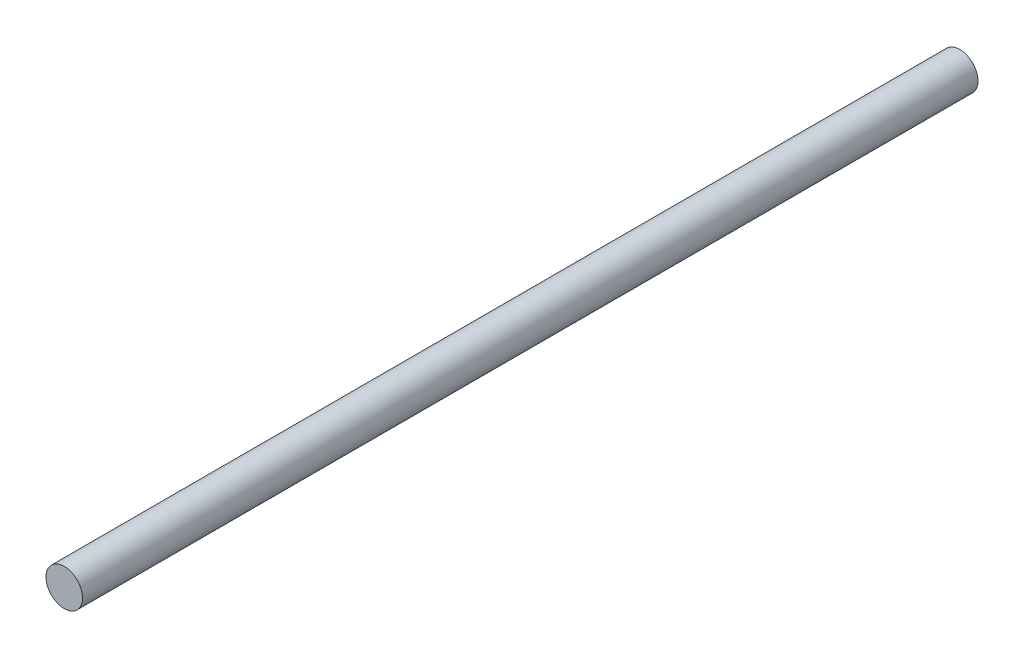
ISO-10303-21;
HEADER;
FILE_DESCRIPTION(('STEP AP214'),'2;1');
FILE_NAME('part.step','',(''),(''),'','','');
FILE_SCHEMA(('AUTOMOTIVE_DESIGN { 1 0 10303 214 1 1 1 1 }'));
ENDSEC;
DATA;
#1=APPLICATION_CONTEXT('core data for automotive mechanical design processes');
#2=APPLICATION_PROTOCOL_DEFINITION('international standard','automotive_design',2000,#1);
#3=PRODUCT_CONTEXT('',#1,'mechanical');
#4=PRODUCT('Part','Part','',(#3));
#5=PRODUCT_RELATED_PRODUCT_CATEGORY('part','',(#4));
#6=PRODUCT_DEFINITION_FORMATION('','',#4);
#7=PRODUCT_DEFINITION_CONTEXT('part definition',#1,'design');
#8=PRODUCT_DEFINITION('design','',#6,#7);
#9=PRODUCT_DEFINITION_SHAPE('','',#8);
#10=(LENGTH_UNIT() NAMED_UNIT(*) SI_UNIT(.MILLI.,.METRE.));
#11=(NAMED_UNIT(*) PLANE_ANGLE_UNIT() SI_UNIT($,.RADIAN.));
#12=(NAMED_UNIT(*) SI_UNIT($,.STERADIAN.) SOLID_ANGLE_UNIT());
#13=UNCERTAINTY_MEASURE_WITH_UNIT(LENGTH_MEASURE(1.E-05),#10,'distance_accuracy_value','');
#14=(GEOMETRIC_REPRESENTATION_CONTEXT(3) GLOBAL_UNCERTAINTY_ASSIGNED_CONTEXT((#13)) GLOBAL_UNIT_ASSIGNED_CONTEXT((#10,
#11,#12)) REPRESENTATION_CONTEXT('',''));
#15=CARTESIAN_POINT('',(0.,0.,0.));
#16=DIRECTION('',(0.,0.,1.));
#17=DIRECTION('',(1.,0.,0.));
#18=AXIS2_PLACEMENT_3D('',#15,#16,#17);
#19=CARTESIAN_POINT('',(0.,0.,196.));
#20=DIRECTION('',(0.,0.,-1.));
#21=DIRECTION('',(-1.,0.,0.));
#22=AXIS2_PLACEMENT_3D('',#19,#20,#21);
#23=CYLINDRICAL_SURFACE('',#22,4.);
#24=CARTESIAN_POINT('',(0.,0.,196.));
#25=DIRECTION('',(0.,0.,1.));
#26=DIRECTION('',(1.,0.,0.));
#27=AXIS2_PLACEMENT_3D('',#24,#25,#26);
#28=CIRCLE('',#27,4.);
#29=CARTESIAN_POINT('',(4.,0.,196.));
#30=VERTEX_POINT('',#29);
#31=EDGE_CURVE('E10',#30,#30,#28,.T.);
#32=ORIENTED_EDGE('',*,*,#31,.F.);
#33=EDGE_LOOP('',(#32));
#34=FACE_BOUND('',#33,.T.);
#35=CARTESIAN_POINT('',(0.,0.,0.));
#36=DIRECTION('',(0.,0.,1.));
#37=DIRECTION('',(1.,0.,0.));
#38=AXIS2_PLACEMENT_3D('',#35,#36,#37);
#39=CIRCLE('',#38,4.);
#40=CARTESIAN_POINT('',(4.,0.,0.));
#41=VERTEX_POINT('',#40);
#42=EDGE_CURVE('E39',#41,#41,#39,.T.);
#43=ORIENTED_EDGE('',*,*,#42,.T.);
#44=EDGE_LOOP('',(#43));
#45=FACE_BOUND('',#44,.T.);
#46=ADVANCED_FACE('F36',(#34,#45),#23,.T.);
#47=CARTESIAN_POINT('',(0.,0.,196.));
#48=DIRECTION('',(0.,0.,1.));
#49=DIRECTION('',(1.,0.,0.));
#50=AXIS2_PLACEMENT_3D('',#47,#48,#49);
#51=PLANE('',#50);
#52=ORIENTED_EDGE('',*,*,#31,.T.);
#53=EDGE_LOOP('',(#52));
#54=FACE_BOUND('',#53,.T.);
#55=ADVANCED_FACE('F51',(#54),#51,.T.);
#56=CARTESIAN_POINT('',(0.,0.,0.));
#57=DIRECTION('',(0.,0.,1.));
#58=DIRECTION('',(1.,0.,0.));
#59=AXIS2_PLACEMENT_3D('',#56,#57,#58);
#60=PLANE('',#59);
#61=ORIENTED_EDGE('',*,*,#42,.F.);
#62=EDGE_LOOP('',(#61));
#63=FACE_BOUND('',#62,.T.);
#64=ADVANCED_FACE('F49',(#63),#60,.F.);
#65=CLOSED_SHELL('',(#46,#55,#64));
#66=MANIFOLD_SOLID_BREP('B2',#65);
#67=ADVANCED_BREP_SHAPE_REPRESENTATION('',(#18,#66),#14);
#68=SHAPE_DEFINITION_REPRESENTATION(#9,#67);
ENDSEC;
END-ISO-10303-21;
